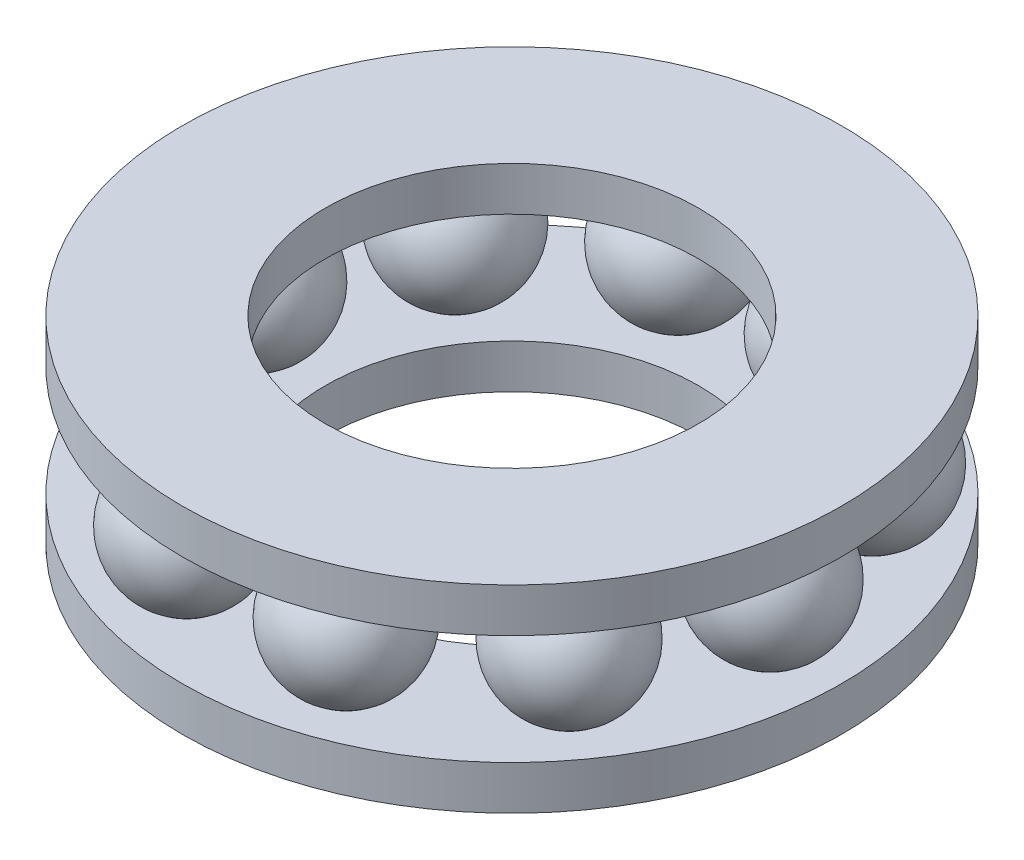
ISO-10303-21;
HEADER;
FILE_DESCRIPTION(('STEP AP214'),'2;1');
FILE_NAME('part.step','',(''),(''),'','','');
FILE_SCHEMA(('AUTOMOTIVE_DESIGN { 1 0 10303 214 1 1 1 1 }'));
ENDSEC;
DATA;
#1=APPLICATION_CONTEXT('core data for automotive mechanical design processes');
#2=APPLICATION_PROTOCOL_DEFINITION('international standard','automotive_design',2000,#1);
#3=PRODUCT_CONTEXT('',#1,'mechanical');
#4=PRODUCT('Part','Part','',(#3));
#5=PRODUCT_RELATED_PRODUCT_CATEGORY('part','',(#4));
#6=PRODUCT_DEFINITION_FORMATION('','',#4);
#7=PRODUCT_DEFINITION_CONTEXT('part definition',#1,'design');
#8=PRODUCT_DEFINITION('design','',#6,#7);
#9=PRODUCT_DEFINITION_SHAPE('','',#8);
#10=(LENGTH_UNIT() NAMED_UNIT(*) SI_UNIT(.MILLI.,.METRE.));
#11=(NAMED_UNIT(*) PLANE_ANGLE_UNIT() SI_UNIT($,.RADIAN.));
#12=(NAMED_UNIT(*) SI_UNIT($,.STERADIAN.) SOLID_ANGLE_UNIT());
#13=UNCERTAINTY_MEASURE_WITH_UNIT(LENGTH_MEASURE(1.E-05),#10,'distance_accuracy_value','');
#14=(GEOMETRIC_REPRESENTATION_CONTEXT(3) GLOBAL_UNCERTAINTY_ASSIGNED_CONTEXT((#13)) GLOBAL_UNIT_ASSIGNED_CONTEXT((#10,
#11,#12)) REPRESENTATION_CONTEXT('',''));
#15=CARTESIAN_POINT('',(0.,0.,0.));
#16=DIRECTION('',(0.,0.,1.));
#17=DIRECTION('',(1.,0.,0.));
#18=AXIS2_PLACEMENT_3D('',#15,#16,#17);
#19=CARTESIAN_POINT('',(11.75,4.5,0.));
#20=DIRECTION('',(-1.,0.,0.));
#21=DIRECTION('',(0.,1.,0.));
#22=AXIS2_PLACEMENT_3D('',#19,#20,#21);
#23=SPHERICAL_SURFACE('',#22,3.);
#24=CARTESIAN_POINT('',(11.75,4.5,0.));
#25=DIRECTION('',(0.,1.,0.));
#26=DIRECTION('',(0.,0.,1.));
#27=AXIS2_PLACEMENT_3D('',#24,#25,#26);
#28=SPHERICAL_SURFACE('',#27,3.);
#29=CARTESIAN_POINT('',(11.75,2.,0.));
#30=DIRECTION('',(0.,1.,0.));
#31=DIRECTION('',(0.,0.,1.));
#32=AXIS2_PLACEMENT_3D('',#29,#30,#31);
#33=CIRCLE('',#32,1.6583123951777);
#34=CARTESIAN_POINT('',(11.75,2.,1.6583123951777));
#35=VERTEX_POINT('',#34);
#36=EDGE_CURVE('E79',#35,#35,#33,.T.);
#37=ORIENTED_EDGE('',*,*,#36,.T.);
#38=EDGE_LOOP('',(#37));
#39=FACE_BOUND('',#38,.T.);
#40=CARTESIAN_POINT('',(11.75,7.,0.));
#41=DIRECTION('',(0.,1.,0.));
#42=DIRECTION('',(0.,0.,1.));
#43=AXIS2_PLACEMENT_3D('',#40,#41,#42);
#44=CIRCLE('',#43,1.6583123951777);
#45=CARTESIAN_POINT('',(11.75,7.,1.6583123951777));
#46=VERTEX_POINT('',#45);
#47=EDGE_CURVE('E92',#46,#46,#44,.F.);
#48=ORIENTED_EDGE('',*,*,#47,.T.);
#49=EDGE_LOOP('',(#48));
#50=FACE_BOUND('',#49,.T.);
#51=ADVANCED_FACE('F44',(#39,#50),#28,.T.);
#52=CARTESIAN_POINT('',(9.50594968390562,4.5,6.90647671443657));
#53=DIRECTION('',(-0.809016994374947,0.,-0.587785252292474));
#54=DIRECTION('',(0.,1.,0.));
#55=AXIS2_PLACEMENT_3D('',#52,#53,#54);
#56=SPHERICAL_SURFACE('',#55,3.);
#57=CARTESIAN_POINT('',(9.50594968390562,4.5,6.90647671443657));
#58=DIRECTION('',(0.,1.,0.));
#59=DIRECTION('',(0.,0.,1.));
#60=AXIS2_PLACEMENT_3D('',#57,#58,#59);
#61=SPHERICAL_SURFACE('',#60,3.);
#62=CARTESIAN_POINT('',(9.50594968390562,2.,6.90647671443657));
#63=DIRECTION('',(0.,1.,0.));
#64=DIRECTION('',(0.,0.,1.));
#65=AXIS2_PLACEMENT_3D('',#62,#63,#64);
#66=CIRCLE('',#65,1.6583123951777);
#67=CARTESIAN_POINT('',(9.50594968390562,2.,8.56478910961427));
#68=VERTEX_POINT('',#67);
#69=EDGE_CURVE('E76',#68,#68,#66,.T.);
#70=ORIENTED_EDGE('',*,*,#69,.T.);
#71=EDGE_LOOP('',(#70));
#72=FACE_BOUND('',#71,.T.);
#73=CARTESIAN_POINT('',(9.50594968390562,7.,6.90647671443657));
#74=DIRECTION('',(0.,1.,0.));
#75=DIRECTION('',(0.,0.,1.));
#76=AXIS2_PLACEMENT_3D('',#73,#74,#75);
#77=CIRCLE('',#76,1.6583123951777);
#78=CARTESIAN_POINT('',(9.50594968390562,7.,8.56478910961427));
#79=VERTEX_POINT('',#78);
#80=EDGE_CURVE('E97',#79,#79,#77,.F.);
#81=ORIENTED_EDGE('',*,*,#80,.T.);
#82=EDGE_LOOP('',(#81));
#83=FACE_BOUND('',#82,.T.);
#84=ADVANCED_FACE('F154',(#72,#83),#61,.T.);
#85=CARTESIAN_POINT('',(3.6309496839056,4.5,11.1749140664681));
#86=DIRECTION('',(-0.309016994374945,0.,-0.951056516295155));
#87=DIRECTION('',(0.,1.,0.));
#88=AXIS2_PLACEMENT_3D('',#85,#86,#87);
#89=SPHERICAL_SURFACE('',#88,3.);
#90=CARTESIAN_POINT('',(3.6309496839056,4.5,11.1749140664681));
#91=DIRECTION('',(0.,1.,0.));
#92=DIRECTION('',(0.,0.,1.));
#93=AXIS2_PLACEMENT_3D('',#90,#91,#92);
#94=SPHERICAL_SURFACE('',#93,3.);
#95=CARTESIAN_POINT('',(3.6309496839056,2.,11.1749140664681));
#96=DIRECTION('',(0.,1.,0.));
#97=DIRECTION('',(0.,0.,1.));
#98=AXIS2_PLACEMENT_3D('',#95,#96,#97);
#99=CIRCLE('',#98,1.6583123951777);
#100=CARTESIAN_POINT('',(3.6309496839056,2.,12.8332264616458));
#101=VERTEX_POINT('',#100);
#102=EDGE_CURVE('E73',#101,#101,#99,.T.);
#103=ORIENTED_EDGE('',*,*,#102,.T.);
#104=EDGE_LOOP('',(#103));
#105=FACE_BOUND('',#104,.T.);
#106=CARTESIAN_POINT('',(3.6309496839056,7.,11.1749140664681));
#107=DIRECTION('',(0.,1.,0.));
#108=DIRECTION('',(0.,0.,1.));
#109=AXIS2_PLACEMENT_3D('',#106,#107,#108);
#110=CIRCLE('',#109,1.6583123951777);
#111=CARTESIAN_POINT('',(3.6309496839056,7.,12.8332264616458));
#112=VERTEX_POINT('',#111);
#113=EDGE_CURVE('E100',#112,#112,#110,.F.);
#114=ORIENTED_EDGE('',*,*,#113,.T.);
#115=EDGE_LOOP('',(#114));
#116=FACE_BOUND('',#115,.T.);
#117=ADVANCED_FACE('F160',(#105,#116),#94,.T.);
#118=CARTESIAN_POINT('',(-3.63094968390568,4.5,11.174914066468));
#119=DIRECTION('',(0.309016994374952,0.,-0.951056516295152));
#120=DIRECTION('',(0.,1.,0.));
#121=AXIS2_PLACEMENT_3D('',#118,#119,#120);
#122=SPHERICAL_SURFACE('',#121,3.);
#123=CARTESIAN_POINT('',(-3.63094968390568,4.5,11.174914066468));
#124=DIRECTION('',(0.,1.,0.));
#125=DIRECTION('',(0.,0.,1.));
#126=AXIS2_PLACEMENT_3D('',#123,#124,#125);
#127=SPHERICAL_SURFACE('',#126,3.);
#128=CARTESIAN_POINT('',(-3.63094968390568,2.,11.174914066468));
#129=DIRECTION('',(0.,1.,0.));
#130=DIRECTION('',(0.,0.,1.));
#131=AXIS2_PLACEMENT_3D('',#128,#129,#130);
#132=CIRCLE('',#131,1.6583123951777);
#133=CARTESIAN_POINT('',(-3.63094968390568,2.,12.8332264616457));
#134=VERTEX_POINT('',#133);
#135=EDGE_CURVE('E70',#134,#134,#132,.T.);
#136=ORIENTED_EDGE('',*,*,#135,.T.);
#137=EDGE_LOOP('',(#136));
#138=FACE_BOUND('',#137,.T.);
#139=CARTESIAN_POINT('',(-3.63094968390568,7.,11.174914066468));
#140=DIRECTION('',(0.,1.,0.));
#141=DIRECTION('',(0.,0.,1.));
#142=AXIS2_PLACEMENT_3D('',#139,#140,#141);
#143=CIRCLE('',#142,1.6583123951777);
#144=CARTESIAN_POINT('',(-3.63094968390568,7.,12.8332264616457));
#145=VERTEX_POINT('',#144);
#146=EDGE_CURVE('E103',#145,#145,#143,.F.);
#147=ORIENTED_EDGE('',*,*,#146,.T.);
#148=EDGE_LOOP('',(#147));
#149=FACE_BOUND('',#148,.T.);
#150=ADVANCED_FACE('F221',(#138,#149),#127,.T.);
#151=CARTESIAN_POINT('',(-9.50594968390567,4.5,6.90647671443651));
#152=DIRECTION('',(0.809016994374951,0.,-0.587785252292469));
#153=DIRECTION('',(0.,1.,0.));
#154=AXIS2_PLACEMENT_3D('',#151,#152,#153);
#155=SPHERICAL_SURFACE('',#154,3.);
#156=CARTESIAN_POINT('',(-9.50594968390567,4.5,6.90647671443651));
#157=DIRECTION('',(0.,1.,0.));
#158=DIRECTION('',(0.,0.,1.));
#159=AXIS2_PLACEMENT_3D('',#156,#157,#158);
#160=SPHERICAL_SURFACE('',#159,3.);
#161=CARTESIAN_POINT('',(-9.50594968390567,2.,6.90647671443651));
#162=DIRECTION('',(0.,1.,0.));
#163=DIRECTION('',(0.,0.,1.));
#164=AXIS2_PLACEMENT_3D('',#161,#162,#163);
#165=CIRCLE('',#164,1.6583123951777);
#166=CARTESIAN_POINT('',(-9.50594968390567,2.,8.5647891096142));
#167=VERTEX_POINT('',#166);
#168=EDGE_CURVE('E67',#167,#167,#165,.T.);
#169=ORIENTED_EDGE('',*,*,#168,.T.);
#170=EDGE_LOOP('',(#169));
#171=FACE_BOUND('',#170,.T.);
#172=CARTESIAN_POINT('',(-9.50594968390567,7.,6.90647671443651));
#173=DIRECTION('',(0.,1.,0.));
#174=DIRECTION('',(0.,0.,1.));
#175=AXIS2_PLACEMENT_3D('',#172,#173,#174);
#176=CIRCLE('',#175,1.6583123951777);
#177=CARTESIAN_POINT('',(-9.50594968390567,7.,8.56478910961421));
#178=VERTEX_POINT('',#177);
#179=EDGE_CURVE('E106',#178,#178,#176,.F.);
#180=ORIENTED_EDGE('',*,*,#179,.T.);
#181=EDGE_LOOP('',(#180));
#182=FACE_BOUND('',#181,.T.);
#183=ADVANCED_FACE('F230',(#171,#182),#160,.T.);
#184=CARTESIAN_POINT('',(-11.75,4.5,0.));
#185=DIRECTION('',(1.,0.,0.));
#186=DIRECTION('',(0.,1.,0.));
#187=AXIS2_PLACEMENT_3D('',#184,#185,#186);
#188=SPHERICAL_SURFACE('',#187,3.);
#189=CARTESIAN_POINT('',(-11.75,4.5,0.));
#190=DIRECTION('',(0.,1.,0.));
#191=DIRECTION('',(0.,0.,1.));
#192=AXIS2_PLACEMENT_3D('',#189,#190,#191);
#193=SPHERICAL_SURFACE('',#192,3.);
#194=CARTESIAN_POINT('',(-11.75,2.,0.));
#195=DIRECTION('',(0.,1.,0.));
#196=DIRECTION('',(0.,0.,1.));
#197=AXIS2_PLACEMENT_3D('',#194,#195,#196);
#198=CIRCLE('',#197,1.6583123951777);
#199=CARTESIAN_POINT('',(-11.75,2.,1.6583123951777));
#200=VERTEX_POINT('',#199);
#201=EDGE_CURVE('E64',#200,#200,#198,.T.);
#202=ORIENTED_EDGE('',*,*,#201,.T.);
#203=EDGE_LOOP('',(#202));
#204=FACE_BOUND('',#203,.T.);
#205=CARTESIAN_POINT('',(-11.75,7.,0.));
#206=DIRECTION('',(0.,1.,0.));
#207=DIRECTION('',(0.,0.,1.));
#208=AXIS2_PLACEMENT_3D('',#205,#206,#207);
#209=CIRCLE('',#208,1.6583123951777);
#210=CARTESIAN_POINT('',(-11.75,7.,1.6583123951777));
#211=VERTEX_POINT('',#210);
#212=EDGE_CURVE('E109',#211,#211,#209,.F.);
#213=ORIENTED_EDGE('',*,*,#212,.T.);
#214=EDGE_LOOP('',(#213));
#215=FACE_BOUND('',#214,.T.);
#216=ADVANCED_FACE('F240',(#204,#215),#193,.T.);
#217=CARTESIAN_POINT('',(-9.50594968390557,4.5,-6.90647671443664));
#218=DIRECTION('',(0.809016994374942,0.,0.58778525229248));
#219=DIRECTION('',(0.,1.,0.));
#220=AXIS2_PLACEMENT_3D('',#217,#218,#219);
#221=SPHERICAL_SURFACE('',#220,3.);
#222=CARTESIAN_POINT('',(-9.50594968390557,4.5,-6.90647671443664));
#223=DIRECTION('',(0.,1.,0.));
#224=DIRECTION('',(0.,0.,1.));
#225=AXIS2_PLACEMENT_3D('',#222,#223,#224);
#226=SPHERICAL_SURFACE('',#225,3.);
#227=CARTESIAN_POINT('',(-9.50594968390557,2.,-6.90647671443664));
#228=DIRECTION('',(0.,1.,0.));
#229=DIRECTION('',(0.,0.,1.));
#230=AXIS2_PLACEMENT_3D('',#227,#228,#229);
#231=CIRCLE('',#230,1.6583123951777);
#232=CARTESIAN_POINT('',(-9.50594968390557,2.,-5.24816431925895));
#233=VERTEX_POINT('',#232);
#234=EDGE_CURVE('E61',#233,#233,#231,.T.);
#235=ORIENTED_EDGE('',*,*,#234,.T.);
#236=EDGE_LOOP('',(#235));
#237=FACE_BOUND('',#236,.T.);
#238=CARTESIAN_POINT('',(-9.50594968390557,7.,-6.90647671443664));
#239=DIRECTION('',(0.,1.,0.));
#240=DIRECTION('',(0.,0.,1.));
#241=AXIS2_PLACEMENT_3D('',#238,#239,#240);
#242=CIRCLE('',#241,1.6583123951777);
#243=CARTESIAN_POINT('',(-9.50594968390557,7.,-5.24816431925894));
#244=VERTEX_POINT('',#243);
#245=EDGE_CURVE('E112',#244,#244,#242,.F.);
#246=ORIENTED_EDGE('',*,*,#245,.T.);
#247=EDGE_LOOP('',(#246));
#248=FACE_BOUND('',#247,.T.);
#249=ADVANCED_FACE('F250',(#237,#248),#226,.T.);
#250=CARTESIAN_POINT('',(-3.63094968390552,4.5,-11.1749140664681));
#251=DIRECTION('',(0.309016994374938,0.,0.951056516295157));
#252=DIRECTION('',(0.,1.,0.));
#253=AXIS2_PLACEMENT_3D('',#250,#251,#252);
#254=SPHERICAL_SURFACE('',#253,3.);
#255=CARTESIAN_POINT('',(-3.63094968390552,4.5,-11.1749140664681));
#256=DIRECTION('',(0.,1.,0.));
#257=DIRECTION('',(0.,0.,1.));
#258=AXIS2_PLACEMENT_3D('',#255,#256,#257);
#259=SPHERICAL_SURFACE('',#258,3.);
#260=CARTESIAN_POINT('',(-3.63094968390552,2.,-11.1749140664681));
#261=DIRECTION('',(0.,1.,0.));
#262=DIRECTION('',(0.,0.,1.));
#263=AXIS2_PLACEMENT_3D('',#260,#261,#262);
#264=CIRCLE('',#263,1.6583123951777);
#265=CARTESIAN_POINT('',(-3.63094968390552,2.,-9.51660167129039));
#266=VERTEX_POINT('',#265);
#267=EDGE_CURVE('E56',#266,#266,#264,.T.);
#268=ORIENTED_EDGE('',*,*,#267,.T.);
#269=EDGE_LOOP('',(#268));
#270=FACE_BOUND('',#269,.T.);
#271=CARTESIAN_POINT('',(-3.63094968390552,7.,-11.1749140664681));
#272=DIRECTION('',(0.,1.,0.));
#273=DIRECTION('',(0.,0.,1.));
#274=AXIS2_PLACEMENT_3D('',#271,#272,#273);
#275=CIRCLE('',#274,1.6583123951777);
#276=CARTESIAN_POINT('',(-3.63094968390552,7.,-9.51660167129039));
#277=VERTEX_POINT('',#276);
#278=EDGE_CURVE('E115',#277,#277,#275,.F.);
#279=ORIENTED_EDGE('',*,*,#278,.T.);
#280=EDGE_LOOP('',(#279));
#281=FACE_BOUND('',#280,.T.);
#282=ADVANCED_FACE('F260',(#270,#281),#259,.T.);
#283=CARTESIAN_POINT('',(3.63094968390576,4.5,-11.174914066468));
#284=DIRECTION('',(-0.309016994374958,0.,0.95105651629515));
#285=DIRECTION('',(0.,1.,0.));
#286=AXIS2_PLACEMENT_3D('',#283,#284,#285);
#287=SPHERICAL_SURFACE('',#286,3.);
#288=CARTESIAN_POINT('',(3.63094968390576,4.5,-11.174914066468));
#289=DIRECTION('',(0.,1.,0.));
#290=DIRECTION('',(0.,0.,1.));
#291=AXIS2_PLACEMENT_3D('',#288,#289,#290);
#292=SPHERICAL_SURFACE('',#291,3.);
#293=CARTESIAN_POINT('',(3.63094968390576,2.,-11.174914066468));
#294=DIRECTION('',(0.,1.,0.));
#295=DIRECTION('',(0.,0.,1.));
#296=AXIS2_PLACEMENT_3D('',#293,#294,#295);
#297=CIRCLE('',#296,1.6583123951777);
#298=CARTESIAN_POINT('',(3.63094968390576,2.,-9.51660167129031));
#299=VERTEX_POINT('',#298);
#300=EDGE_CURVE('E52',#299,#299,#297,.T.);
#301=ORIENTED_EDGE('',*,*,#300,.T.);
#302=EDGE_LOOP('',(#301));
#303=FACE_BOUND('',#302,.T.);
#304=CARTESIAN_POINT('',(3.63094968390576,7.,-11.174914066468));
#305=DIRECTION('',(0.,1.,0.));
#306=DIRECTION('',(0.,0.,1.));
#307=AXIS2_PLACEMENT_3D('',#304,#305,#306);
#308=CIRCLE('',#307,1.6583123951777);
#309=CARTESIAN_POINT('',(3.63094968390576,7.,-9.51660167129031));
#310=VERTEX_POINT('',#309);
#311=EDGE_CURVE('E118',#310,#310,#308,.F.);
#312=ORIENTED_EDGE('',*,*,#311,.T.);
#313=EDGE_LOOP('',(#312));
#314=FACE_BOUND('',#313,.T.);
#315=ADVANCED_FACE('F270',(#303,#314),#292,.T.);
#316=CARTESIAN_POINT('',(9.50594968390572,4.5,-6.90647671443643));
#317=DIRECTION('',(-0.809016994374955,0.,0.587785252292462));
#318=DIRECTION('',(0.,1.,0.));
#319=AXIS2_PLACEMENT_3D('',#316,#317,#318);
#320=SPHERICAL_SURFACE('',#319,3.);
#321=CARTESIAN_POINT('',(9.50594968390572,4.5,-6.90647671443643));
#322=DIRECTION('',(0.,1.,0.));
#323=DIRECTION('',(0.,0.,1.));
#324=AXIS2_PLACEMENT_3D('',#321,#322,#323);
#325=SPHERICAL_SURFACE('',#324,3.);
#326=CARTESIAN_POINT('',(9.50594968390572,2.,-6.90647671443643));
#327=DIRECTION('',(0.,1.,0.));
#328=DIRECTION('',(0.,0.,1.));
#329=AXIS2_PLACEMENT_3D('',#326,#327,#328);
#330=CIRCLE('',#329,1.6583123951777);
#331=CARTESIAN_POINT('',(9.50594968390572,2.,-5.24816431925874));
#332=VERTEX_POINT('',#331);
#333=EDGE_CURVE('E12',#332,#332,#330,.T.);
#334=ORIENTED_EDGE('',*,*,#333,.T.);
#335=EDGE_LOOP('',(#334));
#336=FACE_BOUND('',#335,.T.);
#337=CARTESIAN_POINT('',(9.50594968390572,7.,-6.90647671443643));
#338=DIRECTION('',(0.,1.,0.));
#339=DIRECTION('',(0.,0.,1.));
#340=AXIS2_PLACEMENT_3D('',#337,#338,#339);
#341=CIRCLE('',#340,1.6583123951777);
#342=CARTESIAN_POINT('',(9.50594968390572,7.,-5.24816431925874));
#343=VERTEX_POINT('',#342);
#344=EDGE_CURVE('E48',#343,#343,#341,.F.);
#345=ORIENTED_EDGE('',*,*,#344,.T.);
#346=EDGE_LOOP('',(#345));
#347=FACE_BOUND('',#346,.T.);
#348=ADVANCED_FACE('F169',(#336,#347),#325,.T.);
#349=CARTESIAN_POINT('',(0.,2.,0.));
#350=DIRECTION('',(0.,1.,0.));
#351=DIRECTION('',(0.,0.,1.));
#352=AXIS2_PLACEMENT_3D('',#349,#350,#351);
#353=PLANE('',#352);
#354=ORIENTED_EDGE('',*,*,#333,.F.);
#355=EDGE_LOOP('',(#354));
#356=FACE_BOUND('',#355,.T.);
#357=ORIENTED_EDGE('',*,*,#300,.F.);
#358=EDGE_LOOP('',(#357));
#359=FACE_BOUND('',#358,.T.);
#360=ORIENTED_EDGE('',*,*,#267,.F.);
#361=EDGE_LOOP('',(#360));
#362=FACE_BOUND('',#361,.T.);
#363=ORIENTED_EDGE('',*,*,#234,.F.);
#364=EDGE_LOOP('',(#363));
#365=FACE_BOUND('',#364,.T.);
#366=ORIENTED_EDGE('',*,*,#201,.F.);
#367=EDGE_LOOP('',(#366));
#368=FACE_BOUND('',#367,.T.);
#369=ORIENTED_EDGE('',*,*,#168,.F.);
#370=EDGE_LOOP('',(#369));
#371=FACE_BOUND('',#370,.T.);
#372=ORIENTED_EDGE('',*,*,#135,.F.);
#373=EDGE_LOOP('',(#372));
#374=FACE_BOUND('',#373,.T.);
#375=ORIENTED_EDGE('',*,*,#102,.F.);
#376=EDGE_LOOP('',(#375));
#377=FACE_BOUND('',#376,.T.);
#378=ORIENTED_EDGE('',*,*,#69,.F.);
#379=EDGE_LOOP('',(#378));
#380=FACE_BOUND('',#379,.T.);
#381=ORIENTED_EDGE('',*,*,#36,.F.);
#382=EDGE_LOOP('',(#381));
#383=FACE_BOUND('',#382,.T.);
#384=CARTESIAN_POINT('',(0.,2.,0.));
#385=DIRECTION('',(0.,1.,0.));
#386=DIRECTION('',(0.,0.,1.));
#387=AXIS2_PLACEMENT_3D('',#384,#385,#386);
#388=CIRCLE('',#387,15.);
#389=CARTESIAN_POINT('',(0.,2.,15.));
#390=VERTEX_POINT('',#389);
#391=EDGE_CURVE('E82',#390,#390,#388,.T.);
#392=ORIENTED_EDGE('',*,*,#391,.T.);
#393=EDGE_LOOP('',(#392));
#394=FACE_BOUND('',#393,.T.);
#395=CARTESIAN_POINT('',(0.,2.,0.));
#396=DIRECTION('',(0.,1.,0.));
#397=DIRECTION('',(0.,0.,1.));
#398=AXIS2_PLACEMENT_3D('',#395,#396,#397);
#399=CIRCLE('',#398,8.5);
#400=CARTESIAN_POINT('',(0.,2.,8.5));
#401=VERTEX_POINT('',#400);
#402=EDGE_CURVE('E86',#401,#401,#399,.T.);
#403=ORIENTED_EDGE('',*,*,#402,.F.);
#404=EDGE_LOOP('',(#403));
#405=FACE_BOUND('',#404,.T.);
#406=ADVANCED_FACE('F166',(#356,#359,#362,#365,#368,#371,#374,#377,#380,#383,#394,#405),#353,.T.);
#407=CARTESIAN_POINT('',(0.,0.,0.));
#408=DIRECTION('',(0.,1.,0.));
#409=DIRECTION('',(0.,0.,1.));
#410=AXIS2_PLACEMENT_3D('',#407,#408,#409);
#411=PLANE('',#410);
#412=CARTESIAN_POINT('',(0.,0.,0.));
#413=DIRECTION('',(0.,1.,0.));
#414=DIRECTION('',(0.,0.,1.));
#415=AXIS2_PLACEMENT_3D('',#412,#413,#414);
#416=CIRCLE('',#415,15.);
#417=CARTESIAN_POINT('',(0.,0.,15.));
#418=VERTEX_POINT('',#417);
#419=EDGE_CURVE('E83',#418,#418,#416,.T.);
#420=ORIENTED_EDGE('',*,*,#419,.F.);
#421=EDGE_LOOP('',(#420));
#422=FACE_BOUND('',#421,.T.);
#423=CARTESIAN_POINT('',(0.,0.,0.));
#424=DIRECTION('',(0.,1.,0.));
#425=DIRECTION('',(0.,0.,1.));
#426=AXIS2_PLACEMENT_3D('',#423,#424,#425);
#427=CIRCLE('',#426,8.5);
#428=CARTESIAN_POINT('',(0.,0.,8.5));
#429=VERTEX_POINT('',#428);
#430=EDGE_CURVE('E89',#429,#429,#427,.T.);
#431=ORIENTED_EDGE('',*,*,#430,.T.);
#432=EDGE_LOOP('',(#431));
#433=FACE_BOUND('',#432,.T.);
#434=ADVANCED_FACE('F168',(#422,#433),#411,.F.);
#435=CARTESIAN_POINT('',(0.,2.,0.));
#436=DIRECTION('',(0.,-1.,0.));
#437=DIRECTION('',(0.,0.,-1.));
#438=AXIS2_PLACEMENT_3D('',#435,#436,#437);
#439=CYLINDRICAL_SURFACE('',#438,15.);
#440=ORIENTED_EDGE('',*,*,#391,.F.);
#441=EDGE_LOOP('',(#440));
#442=FACE_BOUND('',#441,.T.);
#443=ORIENTED_EDGE('',*,*,#419,.T.);
#444=EDGE_LOOP('',(#443));
#445=FACE_BOUND('',#444,.T.);
#446=ADVANCED_FACE('F46',(#442,#445),#439,.T.);
#447=CARTESIAN_POINT('',(0.,2.,0.));
#448=DIRECTION('',(0.,-1.,0.));
#449=DIRECTION('',(0.,0.,-1.));
#450=AXIS2_PLACEMENT_3D('',#447,#448,#449);
#451=CYLINDRICAL_SURFACE('',#450,8.5);
#452=ORIENTED_EDGE('',*,*,#402,.T.);
#453=EDGE_LOOP('',(#452));
#454=FACE_BOUND('',#453,.T.);
#455=ORIENTED_EDGE('',*,*,#430,.F.);
#456=EDGE_LOOP('',(#455));
#457=FACE_BOUND('',#456,.T.);
#458=ADVANCED_FACE('F140',(#454,#457),#451,.F.);
#459=CARTESIAN_POINT('',(0.,9.,0.));
#460=DIRECTION('',(0.,1.,0.));
#461=DIRECTION('',(0.,0.,1.));
#462=AXIS2_PLACEMENT_3D('',#459,#460,#461);
#463=PLANE('',#462);
#464=CARTESIAN_POINT('',(0.,9.,0.));
#465=DIRECTION('',(0.,1.,0.));
#466=DIRECTION('',(0.,0.,1.));
#467=AXIS2_PLACEMENT_3D('',#464,#465,#466);
#468=CIRCLE('',#467,15.);
#469=CARTESIAN_POINT('',(0.,9.,15.));
#470=VERTEX_POINT('',#469);
#471=EDGE_CURVE('E124',#470,#470,#468,.T.);
#472=ORIENTED_EDGE('',*,*,#471,.T.);
#473=EDGE_LOOP('',(#472));
#474=FACE_BOUND('',#473,.T.);
#475=CARTESIAN_POINT('',(0.,9.,0.));
#476=DIRECTION('',(0.,1.,0.));
#477=DIRECTION('',(0.,0.,1.));
#478=AXIS2_PLACEMENT_3D('',#475,#476,#477);
#479=CIRCLE('',#478,8.5);
#480=CARTESIAN_POINT('',(0.,9.,8.5));
#481=VERTEX_POINT('',#480);
#482=EDGE_CURVE('E125',#481,#481,#479,.T.);
#483=ORIENTED_EDGE('',*,*,#482,.F.);
#484=EDGE_LOOP('',(#483));
#485=FACE_BOUND('',#484,.T.);
#486=ADVANCED_FACE('F137',(#474,#485),#463,.T.);
#487=CARTESIAN_POINT('',(0.,7.,0.));
#488=DIRECTION('',(0.,1.,0.));
#489=DIRECTION('',(0.,0.,1.));
#490=AXIS2_PLACEMENT_3D('',#487,#488,#489);
#491=PLANE('',#490);
#492=ORIENTED_EDGE('',*,*,#47,.F.);
#493=EDGE_LOOP('',(#492));
#494=FACE_BOUND('',#493,.T.);
#495=ORIENTED_EDGE('',*,*,#80,.F.);
#496=EDGE_LOOP('',(#495));
#497=FACE_BOUND('',#496,.T.);
#498=ORIENTED_EDGE('',*,*,#113,.F.);
#499=EDGE_LOOP('',(#498));
#500=FACE_BOUND('',#499,.T.);
#501=ORIENTED_EDGE('',*,*,#146,.F.);
#502=EDGE_LOOP('',(#501));
#503=FACE_BOUND('',#502,.T.);
#504=ORIENTED_EDGE('',*,*,#179,.F.);
#505=EDGE_LOOP('',(#504));
#506=FACE_BOUND('',#505,.T.);
#507=ORIENTED_EDGE('',*,*,#212,.F.);
#508=EDGE_LOOP('',(#507));
#509=FACE_BOUND('',#508,.T.);
#510=ORIENTED_EDGE('',*,*,#245,.F.);
#511=EDGE_LOOP('',(#510));
#512=FACE_BOUND('',#511,.T.);
#513=ORIENTED_EDGE('',*,*,#278,.F.);
#514=EDGE_LOOP('',(#513));
#515=FACE_BOUND('',#514,.T.);
#516=ORIENTED_EDGE('',*,*,#311,.F.);
#517=EDGE_LOOP('',(#516));
#518=FACE_BOUND('',#517,.T.);
#519=ORIENTED_EDGE('',*,*,#344,.F.);
#520=EDGE_LOOP('',(#519));
#521=FACE_BOUND('',#520,.T.);
#522=CARTESIAN_POINT('',(0.,7.,0.));
#523=DIRECTION('',(0.,1.,0.));
#524=DIRECTION('',(0.,0.,1.));
#525=AXIS2_PLACEMENT_3D('',#522,#523,#524);
#526=CIRCLE('',#525,15.);
#527=CARTESIAN_POINT('',(0.,7.,15.));
#528=VERTEX_POINT('',#527);
#529=EDGE_CURVE('E121',#528,#528,#526,.T.);
#530=ORIENTED_EDGE('',*,*,#529,.F.);
#531=EDGE_LOOP('',(#530));
#532=FACE_BOUND('',#531,.T.);
#533=CARTESIAN_POINT('',(0.,7.,0.));
#534=DIRECTION('',(0.,1.,0.));
#535=DIRECTION('',(0.,0.,1.));
#536=AXIS2_PLACEMENT_3D('',#533,#534,#535);
#537=CIRCLE('',#536,8.5);
#538=CARTESIAN_POINT('',(0.,7.,8.5));
#539=VERTEX_POINT('',#538);
#540=EDGE_CURVE('E128',#539,#539,#537,.T.);
#541=ORIENTED_EDGE('',*,*,#540,.T.);
#542=EDGE_LOOP('',(#541));
#543=FACE_BOUND('',#542,.T.);
#544=ADVANCED_FACE('F139',(#494,#497,#500,#503,#506,#509,#512,#515,#518,#521,#532,#543),#491,.F.);
#545=CARTESIAN_POINT('',(0.,9.,0.));
#546=DIRECTION('',(0.,-1.,0.));
#547=DIRECTION('',(0.,0.,-1.));
#548=AXIS2_PLACEMENT_3D('',#545,#546,#547);
#549=CYLINDRICAL_SURFACE('',#548,15.);
#550=ORIENTED_EDGE('',*,*,#471,.F.);
#551=EDGE_LOOP('',(#550));
#552=FACE_BOUND('',#551,.T.);
#553=ORIENTED_EDGE('',*,*,#529,.T.);
#554=EDGE_LOOP('',(#553));
#555=FACE_BOUND('',#554,.T.);
#556=ADVANCED_FACE('F147',(#552,#555),#549,.T.);
#557=CARTESIAN_POINT('',(0.,9.,0.));
#558=DIRECTION('',(0.,-1.,0.));
#559=DIRECTION('',(0.,0.,-1.));
#560=AXIS2_PLACEMENT_3D('',#557,#558,#559);
#561=CYLINDRICAL_SURFACE('',#560,8.5);
#562=ORIENTED_EDGE('',*,*,#482,.T.);
#563=EDGE_LOOP('',(#562));
#564=FACE_BOUND('',#563,.T.);
#565=ORIENTED_EDGE('',*,*,#540,.F.);
#566=EDGE_LOOP('',(#565));
#567=FACE_BOUND('',#566,.T.);
#568=ADVANCED_FACE('F134',(#564,#567),#561,.F.);
#569=CLOSED_SHELL('',(#51,#84,#117,#150,#183,#216,#249,#282,#315,#348,#406,#434,#446,#458,#486,
#544,#556,#568));
#570=MANIFOLD_SOLID_BREP('B2',#569);
#571=ADVANCED_BREP_SHAPE_REPRESENTATION('',(#18,#570),#14);
#572=SHAPE_DEFINITION_REPRESENTATION(#9,#571);
ENDSEC;
END-ISO-10303-21;
